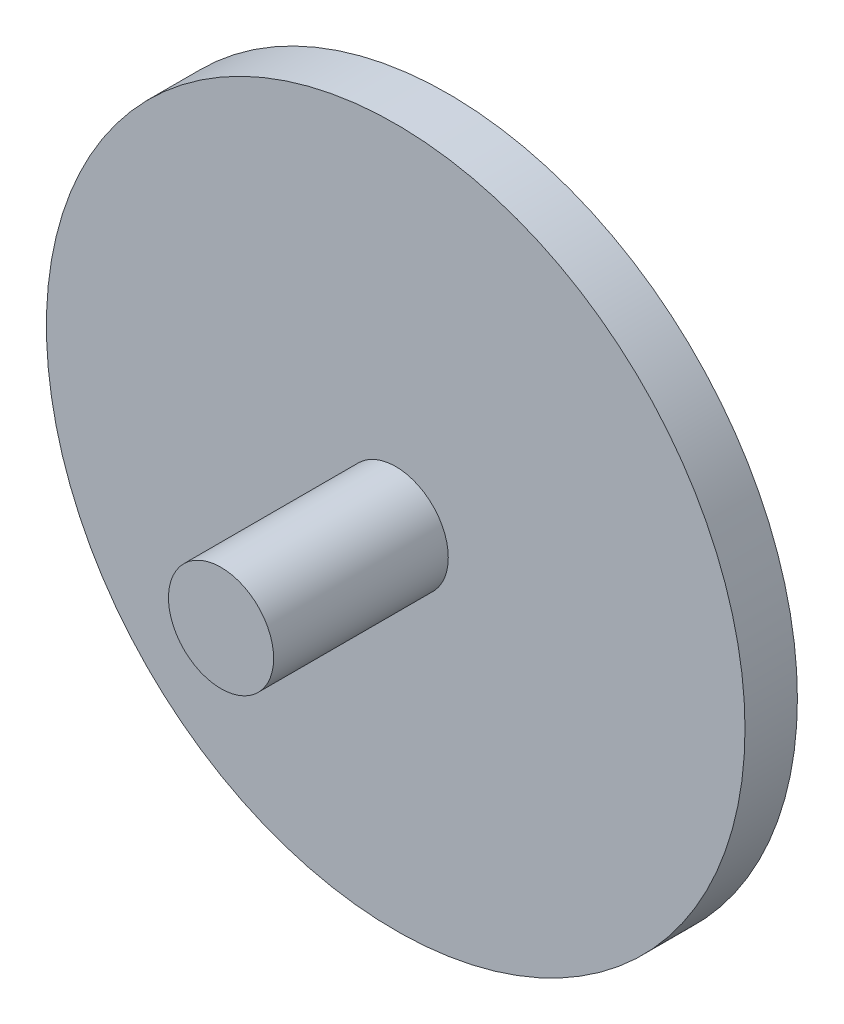
ISO-10303-21;
HEADER;
FILE_DESCRIPTION(('STEP AP214'),'2;1');
FILE_NAME('part.step','',(''),(''),'','','');
FILE_SCHEMA(('AUTOMOTIVE_DESIGN { 1 0 10303 214 1 1 1 1 }'));
ENDSEC;
DATA;
#1=APPLICATION_CONTEXT('core data for automotive mechanical design processes');
#2=APPLICATION_PROTOCOL_DEFINITION('international standard','automotive_design',2000,#1);
#3=PRODUCT_CONTEXT('',#1,'mechanical');
#4=PRODUCT('Part','Part','',(#3));
#5=PRODUCT_RELATED_PRODUCT_CATEGORY('part','',(#4));
#6=PRODUCT_DEFINITION_FORMATION('','',#4);
#7=PRODUCT_DEFINITION_CONTEXT('part definition',#1,'design');
#8=PRODUCT_DEFINITION('design','',#6,#7);
#9=PRODUCT_DEFINITION_SHAPE('','',#8);
#10=(LENGTH_UNIT() NAMED_UNIT(*) SI_UNIT(.MILLI.,.METRE.));
#11=(NAMED_UNIT(*) PLANE_ANGLE_UNIT() SI_UNIT($,.RADIAN.));
#12=(NAMED_UNIT(*) SI_UNIT($,.STERADIAN.) SOLID_ANGLE_UNIT());
#13=UNCERTAINTY_MEASURE_WITH_UNIT(LENGTH_MEASURE(1.E-05),#10,'distance_accuracy_value','');
#14=(GEOMETRIC_REPRESENTATION_CONTEXT(3) GLOBAL_UNCERTAINTY_ASSIGNED_CONTEXT((#13)) GLOBAL_UNIT_ASSIGNED_CONTEXT((#10,
#11,#12)) REPRESENTATION_CONTEXT('',''));
#15=CARTESIAN_POINT('',(0.,0.,0.));
#16=DIRECTION('',(0.,0.,1.));
#17=DIRECTION('',(1.,0.,0.));
#18=AXIS2_PLACEMENT_3D('',#15,#16,#17);
#19=CARTESIAN_POINT('',(0.,0.,1.5));
#20=DIRECTION('',(0.,0.,-1.));
#21=DIRECTION('',(-1.,0.,0.));
#22=AXIS2_PLACEMENT_3D('',#19,#20,#21);
#23=CYLINDRICAL_SURFACE('',#22,10.);
#24=CARTESIAN_POINT('',(0.,0.,1.5));
#25=DIRECTION('',(0.,0.,1.));
#26=DIRECTION('',(1.,0.,0.));
#27=AXIS2_PLACEMENT_3D('',#24,#25,#26);
#28=CIRCLE('',#27,10.);
#29=CARTESIAN_POINT('',(10.,0.,1.5));
#30=VERTEX_POINT('',#29);
#31=EDGE_CURVE('E42',#30,#30,#28,.T.);
#32=ORIENTED_EDGE('',*,*,#31,.F.);
#33=EDGE_LOOP('',(#32));
#34=FACE_BOUND('',#33,.T.);
#35=CARTESIAN_POINT('',(0.,0.,0.));
#36=DIRECTION('',(0.,0.,1.));
#37=DIRECTION('',(1.,0.,0.));
#38=AXIS2_PLACEMENT_3D('',#35,#36,#37);
#39=CIRCLE('',#38,10.);
#40=CARTESIAN_POINT('',(10.,0.,0.));
#41=VERTEX_POINT('',#40);
#42=EDGE_CURVE('E38',#41,#41,#39,.T.);
#43=ORIENTED_EDGE('',*,*,#42,.T.);
#44=EDGE_LOOP('',(#43));
#45=FACE_BOUND('',#44,.T.);
#46=ADVANCED_FACE('F35',(#34,#45),#23,.T.);
#47=CARTESIAN_POINT('',(0.,0.,1.5));
#48=DIRECTION('',(0.,0.,1.));
#49=DIRECTION('',(1.,0.,0.));
#50=AXIS2_PLACEMENT_3D('',#47,#48,#49);
#51=PLANE('',#50);
#52=CARTESIAN_POINT('',(0.,0.,1.5));
#53=DIRECTION('',(0.,0.,1.));
#54=DIRECTION('',(1.,0.,0.));
#55=AXIS2_PLACEMENT_3D('',#52,#53,#54);
#56=CIRCLE('',#55,1.50535748766577);
#57=CARTESIAN_POINT('',(1.50535748766577,0.,1.5));
#58=VERTEX_POINT('',#57);
#59=EDGE_CURVE('E10',#58,#58,#56,.T.);
#60=ORIENTED_EDGE('',*,*,#59,.F.);
#61=EDGE_LOOP('',(#60));
#62=FACE_BOUND('',#61,.T.);
#63=ORIENTED_EDGE('',*,*,#31,.T.);
#64=EDGE_LOOP('',(#63));
#65=FACE_BOUND('',#64,.T.);
#66=ADVANCED_FACE('F59',(#62,#65),#51,.T.);
#67=CARTESIAN_POINT('',(0.,0.,0.));
#68=DIRECTION('',(0.,0.,1.));
#69=DIRECTION('',(1.,0.,0.));
#70=AXIS2_PLACEMENT_3D('',#67,#68,#69);
#71=PLANE('',#70);
#72=ORIENTED_EDGE('',*,*,#42,.F.);
#73=EDGE_LOOP('',(#72));
#74=FACE_BOUND('',#73,.T.);
#75=ADVANCED_FACE('F56',(#74),#71,.F.);
#76=CARTESIAN_POINT('',(0.,0.,6.5));
#77=DIRECTION('',(0.,0.,-1.));
#78=DIRECTION('',(-1.,0.,0.));
#79=AXIS2_PLACEMENT_3D('',#76,#77,#78);
#80=CYLINDRICAL_SURFACE('',#79,1.50535748766577);
#81=CARTESIAN_POINT('',(0.,0.,6.5));
#82=DIRECTION('',(0.,0.,1.));
#83=DIRECTION('',(1.,0.,0.));
#84=AXIS2_PLACEMENT_3D('',#81,#82,#83);
#85=CIRCLE('',#84,1.50535748766577);
#86=CARTESIAN_POINT('',(1.50535748766577,0.,6.5));
#87=VERTEX_POINT('',#86);
#88=EDGE_CURVE('E48',#87,#87,#85,.T.);
#89=ORIENTED_EDGE('',*,*,#88,.F.);
#90=EDGE_LOOP('',(#89));
#91=FACE_BOUND('',#90,.T.);
#92=ORIENTED_EDGE('',*,*,#59,.T.);
#93=EDGE_LOOP('',(#92));
#94=FACE_BOUND('',#93,.T.);
#95=ADVANCED_FACE('F58',(#91,#94),#80,.T.);
#96=CARTESIAN_POINT('',(0.,0.,6.5));
#97=DIRECTION('',(0.,0.,1.));
#98=DIRECTION('',(1.,0.,0.));
#99=AXIS2_PLACEMENT_3D('',#96,#97,#98);
#100=PLANE('',#99);
#101=ORIENTED_EDGE('',*,*,#88,.T.);
#102=EDGE_LOOP('',(#101));
#103=FACE_BOUND('',#102,.T.);
#104=ADVANCED_FACE('F64',(#103),#100,.T.);
#105=CLOSED_SHELL('',(#46,#66,#75,#95,#104));
#106=MANIFOLD_SOLID_BREP('B2',#105);
#107=ADVANCED_BREP_SHAPE_REPRESENTATION('',(#18,#106),#14);
#108=SHAPE_DEFINITION_REPRESENTATION(#9,#107);
ENDSEC;
END-ISO-10303-21;
